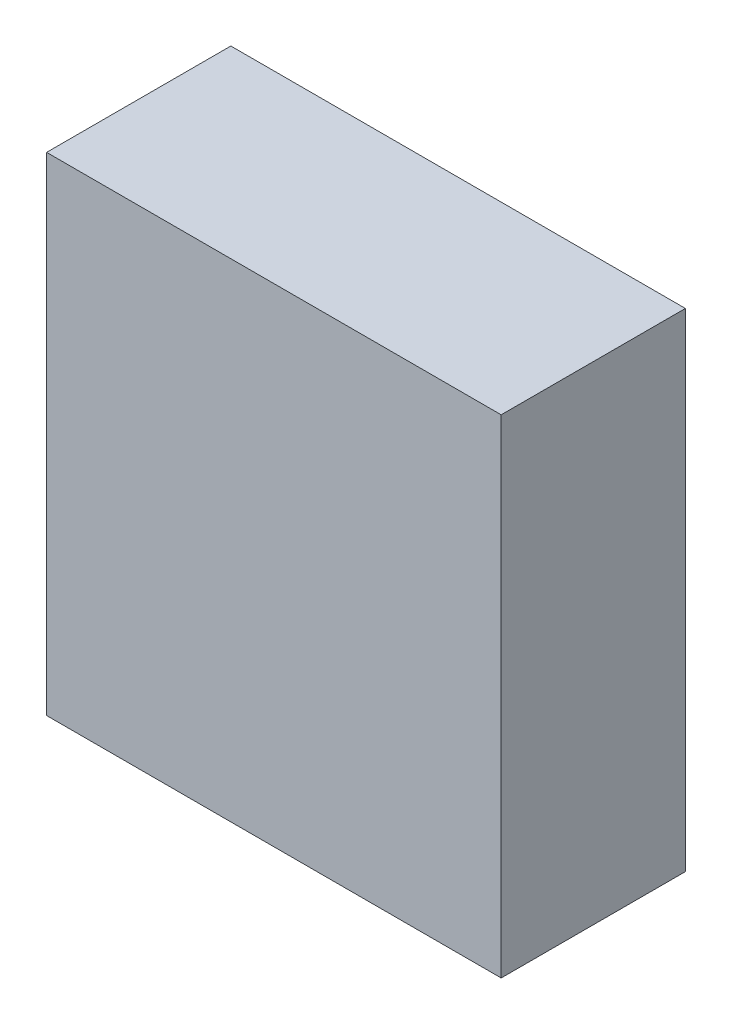
ISO-10303-21;
HEADER;
FILE_DESCRIPTION(('STEP AP214'),'2;1');
FILE_NAME('part.step','',(''),(''),'','','');
FILE_SCHEMA(('AUTOMOTIVE_DESIGN { 1 0 10303 214 1 1 1 1 }'));
ENDSEC;
DATA;
#1=APPLICATION_CONTEXT('core data for automotive mechanical design processes');
#2=APPLICATION_PROTOCOL_DEFINITION('international standard','automotive_design',2000,#1);
#3=PRODUCT_CONTEXT('',#1,'mechanical');
#4=PRODUCT('Part','Part','',(#3));
#5=PRODUCT_RELATED_PRODUCT_CATEGORY('part','',(#4));
#6=PRODUCT_DEFINITION_FORMATION('','',#4);
#7=PRODUCT_DEFINITION_CONTEXT('part definition',#1,'design');
#8=PRODUCT_DEFINITION('design','',#6,#7);
#9=PRODUCT_DEFINITION_SHAPE('','',#8);
#10=(LENGTH_UNIT() NAMED_UNIT(*) SI_UNIT(.MILLI.,.METRE.));
#11=(NAMED_UNIT(*) PLANE_ANGLE_UNIT() SI_UNIT($,.RADIAN.));
#12=(NAMED_UNIT(*) SI_UNIT($,.STERADIAN.) SOLID_ANGLE_UNIT());
#13=UNCERTAINTY_MEASURE_WITH_UNIT(LENGTH_MEASURE(1.E-05),#10,'distance_accuracy_value','');
#14=(GEOMETRIC_REPRESENTATION_CONTEXT(3) GLOBAL_UNCERTAINTY_ASSIGNED_CONTEXT((#13)) GLOBAL_UNIT_ASSIGNED_CONTEXT((#10,
#11,#12)) REPRESENTATION_CONTEXT('',''));
#15=CARTESIAN_POINT('',(0.,0.,0.));
#16=DIRECTION('',(0.,0.,1.));
#17=DIRECTION('',(1.,0.,0.));
#18=AXIS2_PLACEMENT_3D('',#15,#16,#17);
#19=CARTESIAN_POINT('',(-1.60001532140717,3.27000572552663,-4.61112093925476));
#20=DIRECTION('',(-1.,1.74845553146952E-07,0.));
#21=DIRECTION('',(-1.74845553146952E-07,-1.,0.));
#22=AXIS2_PLACEMENT_3D('',#19,#20,#21);
#23=PLANE('',#22);
#24=DIRECTION('',(-1.7484555315925E-07,-0.999999999999985,0.));
#25=VECTOR('',#24,1.);
#26=CARTESIAN_POINT('',(-1.60001532140717,3.27000572552663,-4.61112093925476));
#27=LINE('',#26,#25);
#28=CARTESIAN_POINT('',(-1.60001532140717,3.27000572552663,-4.61112093925476));
#29=VERTEX_POINT('',#28);
#30=CARTESIAN_POINT('',(-1.60001646489724,-3.26999519000071,-4.61112093925476));
#31=VERTEX_POINT('',#30);
#32=EDGE_CURVE('E11',#29,#31,#27,.T.);
#33=ORIENTED_EDGE('',*,*,#32,.T.);
#34=DIRECTION('',(0.,0.,1.));
#35=VECTOR('',#34,1.);
#36=CARTESIAN_POINT('',(-1.60001646489725,-3.26999519000071,-4.61112093925476));
#37=LINE('',#36,#35);
#38=CARTESIAN_POINT('',(-1.60001646489724,-3.26999519000071,-2.14112091064453));
#39=VERTEX_POINT('',#38);
#40=EDGE_CURVE('E88',#31,#39,#37,.T.);
#41=ORIENTED_EDGE('',*,*,#40,.T.);
#42=DIRECTION('',(-1.7484555315925E-07,-0.999999999999985,0.));
#43=VECTOR('',#42,1.);
#44=CARTESIAN_POINT('',(-1.60001532140717,3.27000572552663,-2.14112091064453));
#45=LINE('',#44,#43);
#46=CARTESIAN_POINT('',(-1.60001532140717,3.27000572552663,-2.14112091064453));
#47=VERTEX_POINT('',#46);
#48=EDGE_CURVE('E83',#47,#39,#45,.T.);
#49=ORIENTED_EDGE('',*,*,#48,.F.);
#50=DIRECTION('',(0.,0.,1.));
#51=VECTOR('',#50,1.);
#52=CARTESIAN_POINT('',(-1.60001532140717,3.27000572552664,-4.61112093925476));
#53=LINE('',#52,#51);
#54=EDGE_CURVE('E72',#29,#47,#53,.T.);
#55=ORIENTED_EDGE('',*,*,#54,.F.);
#56=EDGE_LOOP('',(#33,#41,#49,#55));
#57=FACE_BOUND('',#56,.T.);
#58=ADVANCED_FACE('F17',(#57),#23,.T.);
#59=CARTESIAN_POINT('',(-1.60001646489724,-3.26999519000071,-4.61112093925476));
#60=DIRECTION('',(-1.74845553146952E-07,-1.,0.));
#61=DIRECTION('',(1.,-1.74845553146952E-07,0.));
#62=AXIS2_PLACEMENT_3D('',#59,#60,#61);
#63=PLANE('',#62);
#64=DIRECTION('',(0.999999999999985,-1.74845553118772E-07,0.));
#65=VECTOR('',#64,1.);
#66=CARTESIAN_POINT('',(-1.60001646489724,-3.26999519000071,-4.61112093925476));
#67=LINE('',#66,#65);
#68=CARTESIAN_POINT('',(4.49501527338401,-3.2699962556899,-4.61112093925476));
#69=VERTEX_POINT('',#68);
#70=EDGE_CURVE('E24',#31,#69,#67,.T.);
#71=ORIENTED_EDGE('',*,*,#70,.T.);
#72=DIRECTION('',(0.,0.,1.));
#73=VECTOR('',#72,1.);
#74=CARTESIAN_POINT('',(4.49501527338401,-3.26999625568991,-4.61112093925476));
#75=LINE('',#74,#73);
#76=CARTESIAN_POINT('',(4.49501527338401,-3.2699962556899,-2.14112091064453));
#77=VERTEX_POINT('',#76);
#78=EDGE_CURVE('E85',#69,#77,#75,.T.);
#79=ORIENTED_EDGE('',*,*,#78,.T.);
#80=DIRECTION('',(0.999999999999985,-1.74845553118772E-07,0.));
#81=VECTOR('',#80,1.);
#82=CARTESIAN_POINT('',(-1.60001646489724,-3.26999519000071,-2.14112091064453));
#83=LINE('',#82,#81);
#84=EDGE_CURVE('E66',#39,#77,#83,.T.);
#85=ORIENTED_EDGE('',*,*,#84,.F.);
#86=ORIENTED_EDGE('',*,*,#40,.F.);
#87=EDGE_LOOP('',(#71,#79,#85,#86));
#88=FACE_BOUND('',#87,.T.);
#89=ADVANCED_FACE('F89',(#88),#63,.T.);
#90=CARTESIAN_POINT('',(4.49501527338401,-3.2699962556899,-4.61112093925476));
#91=DIRECTION('',(1.,-1.74845553146952E-07,0.));
#92=DIRECTION('',(1.74845553146952E-07,1.,0.));
#93=AXIS2_PLACEMENT_3D('',#90,#91,#92);
#94=PLANE('',#93);
#95=DIRECTION('',(1.7484555315925E-07,0.999999999999985,0.));
#96=VECTOR('',#95,1.);
#97=CARTESIAN_POINT('',(4.49501527338401,-3.2699962556899,-4.61112093925476));
#98=LINE('',#97,#96);
#99=CARTESIAN_POINT('',(4.49501641687408,3.27000465983744,-4.61112093925476));
#100=VERTEX_POINT('',#99);
#101=EDGE_CURVE('E62',#69,#100,#98,.T.);
#102=ORIENTED_EDGE('',*,*,#101,.T.);
#103=DIRECTION('',(0.,0.,1.));
#104=VECTOR('',#103,1.);
#105=CARTESIAN_POINT('',(4.49501641687409,3.27000465983744,-4.61112093925476));
#106=LINE('',#105,#104);
#107=CARTESIAN_POINT('',(4.49501641687408,3.27000465983744,-2.14112091064453));
#108=VERTEX_POINT('',#107);
#109=EDGE_CURVE('E55',#100,#108,#106,.T.);
#110=ORIENTED_EDGE('',*,*,#109,.T.);
#111=DIRECTION('',(1.7484555315925E-07,0.999999999999985,0.));
#112=VECTOR('',#111,1.);
#113=CARTESIAN_POINT('',(4.49501527338401,-3.2699962556899,-2.14112091064453));
#114=LINE('',#113,#112);
#115=EDGE_CURVE('E59',#77,#108,#114,.T.);
#116=ORIENTED_EDGE('',*,*,#115,.F.);
#117=ORIENTED_EDGE('',*,*,#78,.F.);
#118=EDGE_LOOP('',(#102,#110,#116,#117));
#119=FACE_BOUND('',#118,.T.);
#120=ADVANCED_FACE('F57',(#119),#94,.T.);
#121=CARTESIAN_POINT('',(4.49501641687408,3.27000465983744,-4.61112093925476));
#122=DIRECTION('',(1.74845553146952E-07,1.,0.));
#123=DIRECTION('',(-1.,1.74845553146952E-07,0.));
#124=AXIS2_PLACEMENT_3D('',#121,#122,#123);
#125=PLANE('',#124);
#126=DIRECTION('',(-0.999999999999985,1.74845553118772E-07,0.));
#127=VECTOR('',#126,1.);
#128=CARTESIAN_POINT('',(4.49501641687408,3.27000465983744,-4.61112093925476));
#129=LINE('',#128,#127);
#130=EDGE_CURVE('E65',#100,#29,#129,.T.);
#131=ORIENTED_EDGE('',*,*,#130,.T.);
#132=ORIENTED_EDGE('',*,*,#54,.T.);
#133=DIRECTION('',(-0.999999999999985,1.74845553118772E-07,0.));
#134=VECTOR('',#133,1.);
#135=CARTESIAN_POINT('',(4.49501641687408,3.27000465983744,-2.14112091064453));
#136=LINE('',#135,#134);
#137=EDGE_CURVE('E70',#108,#47,#136,.T.);
#138=ORIENTED_EDGE('',*,*,#137,.F.);
#139=ORIENTED_EDGE('',*,*,#109,.F.);
#140=EDGE_LOOP('',(#131,#132,#138,#139));
#141=FACE_BOUND('',#140,.T.);
#142=ADVANCED_FACE('F71',(#141),#125,.T.);
#143=CARTESIAN_POINT('',(-473.275024414062,-118.549919128418,-2.14112091064453));
#144=DIRECTION('',(0.,0.,1.));
#145=DIRECTION('',(1.,-1.74845553146952E-07,0.));
#146=AXIS2_PLACEMENT_3D('',#143,#144,#145);
#147=PLANE('',#146);
#148=ORIENTED_EDGE('',*,*,#48,.T.);
#149=ORIENTED_EDGE('',*,*,#84,.T.);
#150=ORIENTED_EDGE('',*,*,#115,.T.);
#151=ORIENTED_EDGE('',*,*,#137,.T.);
#152=EDGE_LOOP('',(#148,#149,#150,#151));
#153=FACE_BOUND('',#152,.T.);
#154=ADVANCED_FACE('F76',(#153),#147,.T.);
#155=CARTESIAN_POINT('',(-473.275024414062,-118.549919128418,-4.61112093925476));
#156=DIRECTION('',(0.,0.,1.));
#157=DIRECTION('',(1.,-1.74845553146952E-07,0.));
#158=AXIS2_PLACEMENT_3D('',#155,#156,#157);
#159=PLANE('',#158);
#160=ORIENTED_EDGE('',*,*,#130,.F.);
#161=ORIENTED_EDGE('',*,*,#101,.F.);
#162=ORIENTED_EDGE('',*,*,#70,.F.);
#163=ORIENTED_EDGE('',*,*,#32,.F.);
#164=EDGE_LOOP('',(#160,#161,#162,#163));
#165=FACE_BOUND('',#164,.T.);
#166=ADVANCED_FACE('F91',(#165),#159,.F.);
#167=CLOSED_SHELL('',(#58,#89,#120,#142,#154,#166));
#168=MANIFOLD_SOLID_BREP('B1',#167);
#169=ADVANCED_BREP_SHAPE_REPRESENTATION('',(#18,#168),#14);
#170=SHAPE_DEFINITION_REPRESENTATION(#9,#169);
ENDSEC;
END-ISO-10303-21;
